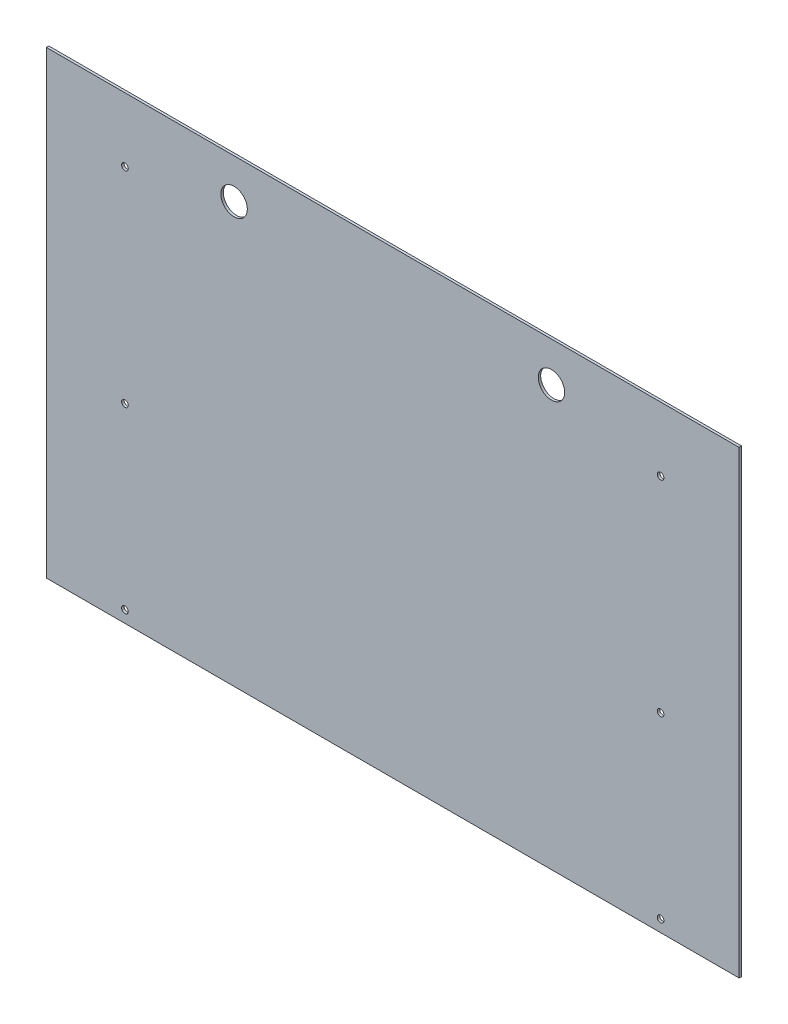
ISO-10303-21;
HEADER;
FILE_DESCRIPTION(('STEP AP214'),'2;1');
FILE_NAME('part.step','',(''),(''),'','','');
FILE_SCHEMA(('AUTOMOTIVE_DESIGN { 1 0 10303 214 1 1 1 1 }'));
ENDSEC;
DATA;
#1=APPLICATION_CONTEXT('core data for automotive mechanical design processes');
#2=APPLICATION_PROTOCOL_DEFINITION('international standard','automotive_design',2000,#1);
#3=PRODUCT_CONTEXT('',#1,'mechanical');
#4=PRODUCT('Part','Part','',(#3));
#5=PRODUCT_RELATED_PRODUCT_CATEGORY('part','',(#4));
#6=PRODUCT_DEFINITION_FORMATION('','',#4);
#7=PRODUCT_DEFINITION_CONTEXT('part definition',#1,'design');
#8=PRODUCT_DEFINITION('design','',#6,#7);
#9=PRODUCT_DEFINITION_SHAPE('','',#8);
#10=(LENGTH_UNIT() NAMED_UNIT(*) SI_UNIT(.MILLI.,.METRE.));
#11=(NAMED_UNIT(*) PLANE_ANGLE_UNIT() SI_UNIT($,.RADIAN.));
#12=(NAMED_UNIT(*) SI_UNIT($,.STERADIAN.) SOLID_ANGLE_UNIT());
#13=UNCERTAINTY_MEASURE_WITH_UNIT(LENGTH_MEASURE(1.E-05),#10,'distance_accuracy_value','');
#14=(GEOMETRIC_REPRESENTATION_CONTEXT(3) GLOBAL_UNCERTAINTY_ASSIGNED_CONTEXT((#13)) GLOBAL_UNIT_ASSIGNED_CONTEXT((#10,
#11,#12)) REPRESENTATION_CONTEXT('',''));
#15=CARTESIAN_POINT('',(0.,0.,0.));
#16=DIRECTION('',(0.,0.,1.));
#17=DIRECTION('',(1.,0.,0.));
#18=AXIS2_PLACEMENT_3D('',#15,#16,#17);
#19=CARTESIAN_POINT('',(-665.162499999999,1079.5,4.7625));
#20=DIRECTION('',(1.,0.,0.));
#21=DIRECTION('',(0.,1.,0.));
#22=AXIS2_PLACEMENT_3D('',#19,#20,#21);
#23=PLANE('',#22);
#24=DIRECTION('',(0.,-1.,0.));
#25=VECTOR('',#24,1.);
#26=CARTESIAN_POINT('',(-665.162499999999,1079.5,0.));
#27=LINE('',#26,#25);
#28=CARTESIAN_POINT('',(-665.162499999999,1079.5,0.));
#29=VERTEX_POINT('',#28);
#30=CARTESIAN_POINT('',(-665.162499999999,196.85,0.));
#31=VERTEX_POINT('',#30);
#32=EDGE_CURVE('E96',#29,#31,#27,.T.);
#33=ORIENTED_EDGE('',*,*,#32,.T.);
#34=DIRECTION('',(0.,0.,-1.));
#35=VECTOR('',#34,1.);
#36=CARTESIAN_POINT('',(-665.162499999999,196.85,4.7625));
#37=LINE('',#36,#35);
#38=CARTESIAN_POINT('',(-665.162499999999,196.85,4.7625));
#39=VERTEX_POINT('',#38);
#40=EDGE_CURVE('E11',#39,#31,#37,.T.);
#41=ORIENTED_EDGE('',*,*,#40,.F.);
#42=DIRECTION('',(0.,-1.,0.));
#43=VECTOR('',#42,1.);
#44=CARTESIAN_POINT('',(-665.162499999999,1079.5,4.7625));
#45=LINE('',#44,#43);
#46=CARTESIAN_POINT('',(-665.162499999999,1079.5,4.7625));
#47=VERTEX_POINT('',#46);
#48=EDGE_CURVE('E84',#47,#39,#45,.T.);
#49=ORIENTED_EDGE('',*,*,#48,.F.);
#50=DIRECTION('',(0.,0.,-1.));
#51=VECTOR('',#50,1.);
#52=CARTESIAN_POINT('',(-665.162499999999,1079.5,4.7625));
#53=LINE('',#52,#51);
#54=EDGE_CURVE('E92',#47,#29,#53,.T.);
#55=ORIENTED_EDGE('',*,*,#54,.T.);
#56=EDGE_LOOP('',(#33,#41,#49,#55));
#57=FACE_BOUND('',#56,.T.);
#58=ADVANCED_FACE('F33',(#57),#23,.F.);
#59=CARTESIAN_POINT('',(-665.162499999999,196.85,4.7625));
#60=DIRECTION('',(0.,1.,0.));
#61=DIRECTION('',(0.,0.,1.));
#62=AXIS2_PLACEMENT_3D('',#59,#60,#61);
#63=PLANE('',#62);
#64=DIRECTION('',(1.,0.,0.));
#65=VECTOR('',#64,1.);
#66=CARTESIAN_POINT('',(-665.162499999999,196.85,0.));
#67=LINE('',#66,#65);
#68=CARTESIAN_POINT('',(665.162499999999,196.85,0.));
#69=VERTEX_POINT('',#68);
#70=EDGE_CURVE('E88',#31,#69,#67,.T.);
#71=ORIENTED_EDGE('',*,*,#70,.T.);
#72=DIRECTION('',(0.,0.,-1.));
#73=VECTOR('',#72,1.);
#74=CARTESIAN_POINT('',(665.162499999999,196.85,4.7625));
#75=LINE('',#74,#73);
#76=CARTESIAN_POINT('',(665.162499999999,196.85,4.7625));
#77=VERTEX_POINT('',#76);
#78=EDGE_CURVE('E41',#77,#69,#75,.T.);
#79=ORIENTED_EDGE('',*,*,#78,.F.);
#80=DIRECTION('',(1.,0.,0.));
#81=VECTOR('',#80,1.);
#82=CARTESIAN_POINT('',(-665.162499999999,196.85,4.7625));
#83=LINE('',#82,#81);
#84=EDGE_CURVE('E79',#39,#77,#83,.T.);
#85=ORIENTED_EDGE('',*,*,#84,.F.);
#86=ORIENTED_EDGE('',*,*,#40,.T.);
#87=EDGE_LOOP('',(#71,#79,#85,#86));
#88=FACE_BOUND('',#87,.T.);
#89=ADVANCED_FACE('F87',(#88),#63,.F.);
#90=CARTESIAN_POINT('',(665.162499999999,1079.5,4.7625));
#91=DIRECTION('',(-1.,0.,0.));
#92=DIRECTION('',(0.,-1.,0.));
#93=AXIS2_PLACEMENT_3D('',#90,#91,#92);
#94=PLANE('',#93);
#95=DIRECTION('',(0.,1.,0.));
#96=VECTOR('',#95,1.);
#97=CARTESIAN_POINT('',(665.162499999999,1079.5,0.));
#98=LINE('',#97,#96);
#99=CARTESIAN_POINT('',(665.162499999999,1079.5,0.));
#100=VERTEX_POINT('',#99);
#101=EDGE_CURVE('E66',#69,#100,#98,.T.);
#102=ORIENTED_EDGE('',*,*,#101,.T.);
#103=DIRECTION('',(0.,0.,-1.));
#104=VECTOR('',#103,1.);
#105=CARTESIAN_POINT('',(665.162499999999,1079.5,4.7625));
#106=LINE('',#105,#104);
#107=CARTESIAN_POINT('',(665.162499999999,1079.5,4.7625));
#108=VERTEX_POINT('',#107);
#109=EDGE_CURVE('E89',#108,#100,#106,.T.);
#110=ORIENTED_EDGE('',*,*,#109,.F.);
#111=DIRECTION('',(0.,1.,0.));
#112=VECTOR('',#111,1.);
#113=CARTESIAN_POINT('',(665.162499999999,1079.5,4.7625));
#114=LINE('',#113,#112);
#115=EDGE_CURVE('E82',#77,#108,#114,.T.);
#116=ORIENTED_EDGE('',*,*,#115,.F.);
#117=ORIENTED_EDGE('',*,*,#78,.T.);
#118=EDGE_LOOP('',(#102,#110,#116,#117));
#119=FACE_BOUND('',#118,.T.);
#120=ADVANCED_FACE('F90',(#119),#94,.F.);
#121=CARTESIAN_POINT('',(-665.162499999999,1079.5,4.7625));
#122=DIRECTION('',(0.,-1.,0.));
#123=DIRECTION('',(0.,0.,-1.));
#124=AXIS2_PLACEMENT_3D('',#121,#122,#123);
#125=PLANE('',#124);
#126=DIRECTION('',(-1.,0.,0.));
#127=VECTOR('',#126,1.);
#128=CARTESIAN_POINT('',(-665.162499999999,1079.5,0.));
#129=LINE('',#128,#127);
#130=EDGE_CURVE('E72',#100,#29,#129,.T.);
#131=ORIENTED_EDGE('',*,*,#130,.T.);
#132=ORIENTED_EDGE('',*,*,#54,.F.);
#133=DIRECTION('',(-1.,0.,0.));
#134=VECTOR('',#133,1.);
#135=CARTESIAN_POINT('',(-665.162499999999,1079.5,4.7625));
#136=LINE('',#135,#134);
#137=EDGE_CURVE('E49',#108,#47,#136,.T.);
#138=ORIENTED_EDGE('',*,*,#137,.F.);
#139=ORIENTED_EDGE('',*,*,#109,.T.);
#140=EDGE_LOOP('',(#131,#132,#138,#139));
#141=FACE_BOUND('',#140,.T.);
#142=ADVANCED_FACE('F104',(#141),#125,.F.);
#143=CARTESIAN_POINT('',(-665.162499999999,196.85,4.7625));
#144=DIRECTION('',(0.,0.,1.));
#145=DIRECTION('',(1.,0.,0.));
#146=AXIS2_PLACEMENT_3D('',#143,#144,#145);
#147=PLANE('',#146);
#148=CARTESIAN_POINT('',(-304.8,1003.3,4.7625));
#149=DIRECTION('',(0.,0.,1.));
#150=DIRECTION('',(-1.,0.,0.));
#151=AXIS2_PLACEMENT_3D('',#148,#149,#150);
#152=CIRCLE('',#151,25.4);
#153=CARTESIAN_POINT('',(-330.2,1003.3,4.7625));
#154=VERTEX_POINT('',#153);
#155=EDGE_CURVE('E152',#154,#154,#152,.T.);
#156=ORIENTED_EDGE('',*,*,#155,.F.);
#157=EDGE_LOOP('',(#156));
#158=FACE_BOUND('',#157,.T.);
#159=CARTESIAN_POINT('',(304.8,1003.3,4.7625));
#160=DIRECTION('',(0.,0.,1.));
#161=DIRECTION('',(1.,0.,0.));
#162=AXIS2_PLACEMENT_3D('',#159,#160,#161);
#163=CIRCLE('',#162,25.4);
#164=CARTESIAN_POINT('',(330.2,1003.3,4.7625));
#165=VERTEX_POINT('',#164);
#166=EDGE_CURVE('E146',#165,#165,#163,.T.);
#167=ORIENTED_EDGE('',*,*,#166,.F.);
#168=EDGE_LOOP('',(#167));
#169=FACE_BOUND('',#168,.T.);
#170=CARTESIAN_POINT('',(-514.35,956.31,4.7625));
#171=DIRECTION('',(0.,0.,1.));
#172=DIRECTION('',(-1.,0.,0.));
#173=AXIS2_PLACEMENT_3D('',#170,#171,#172);
#174=CIRCLE('',#173,6.34999999999994);
#175=CARTESIAN_POINT('',(-520.7,956.31,4.7625));
#176=VERTEX_POINT('',#175);
#177=EDGE_CURVE('E140',#176,#176,#174,.T.);
#178=ORIENTED_EDGE('',*,*,#177,.F.);
#179=EDGE_LOOP('',(#178));
#180=FACE_BOUND('',#179,.T.);
#181=CARTESIAN_POINT('',(-514.35,562.61,4.7625));
#182=DIRECTION('',(0.,0.,1.));
#183=DIRECTION('',(-1.,0.,0.));
#184=AXIS2_PLACEMENT_3D('',#181,#182,#183);
#185=CIRCLE('',#184,6.34999999999994);
#186=CARTESIAN_POINT('',(-520.7,562.61,4.7625));
#187=VERTEX_POINT('',#186);
#188=EDGE_CURVE('E134',#187,#187,#185,.T.);
#189=ORIENTED_EDGE('',*,*,#188,.F.);
#190=EDGE_LOOP('',(#189));
#191=FACE_BOUND('',#190,.T.);
#192=CARTESIAN_POINT('',(-514.35,219.71,4.7625));
#193=DIRECTION('',(0.,0.,1.));
#194=DIRECTION('',(-1.,0.,0.));
#195=AXIS2_PLACEMENT_3D('',#192,#193,#194);
#196=CIRCLE('',#195,6.34999999999994);
#197=CARTESIAN_POINT('',(-520.7,219.71,4.7625));
#198=VERTEX_POINT('',#197);
#199=EDGE_CURVE('E128',#198,#198,#196,.T.);
#200=ORIENTED_EDGE('',*,*,#199,.F.);
#201=EDGE_LOOP('',(#200));
#202=FACE_BOUND('',#201,.T.);
#203=CARTESIAN_POINT('',(514.35,219.71,4.7625));
#204=DIRECTION('',(0.,0.,1.));
#205=DIRECTION('',(1.,0.,0.));
#206=AXIS2_PLACEMENT_3D('',#203,#204,#205);
#207=CIRCLE('',#206,6.34999999999994);
#208=CARTESIAN_POINT('',(520.7,219.71,4.7625));
#209=VERTEX_POINT('',#208);
#210=EDGE_CURVE('E122',#209,#209,#207,.T.);
#211=ORIENTED_EDGE('',*,*,#210,.F.);
#212=EDGE_LOOP('',(#211));
#213=FACE_BOUND('',#212,.T.);
#214=CARTESIAN_POINT('',(514.35,562.61,4.7625));
#215=DIRECTION('',(0.,0.,1.));
#216=DIRECTION('',(1.,0.,0.));
#217=AXIS2_PLACEMENT_3D('',#214,#215,#216);
#218=CIRCLE('',#217,6.34999999999994);
#219=CARTESIAN_POINT('',(520.7,562.61,4.7625));
#220=VERTEX_POINT('',#219);
#221=EDGE_CURVE('E116',#220,#220,#218,.T.);
#222=ORIENTED_EDGE('',*,*,#221,.F.);
#223=EDGE_LOOP('',(#222));
#224=FACE_BOUND('',#223,.T.);
#225=CARTESIAN_POINT('',(514.35,956.31,4.7625));
#226=DIRECTION('',(0.,0.,1.));
#227=DIRECTION('',(1.,0.,0.));
#228=AXIS2_PLACEMENT_3D('',#225,#226,#227);
#229=CIRCLE('',#228,6.34999999999994);
#230=CARTESIAN_POINT('',(520.7,956.31,4.7625));
#231=VERTEX_POINT('',#230);
#232=EDGE_CURVE('E110',#231,#231,#229,.T.);
#233=ORIENTED_EDGE('',*,*,#232,.F.);
#234=EDGE_LOOP('',(#233));
#235=FACE_BOUND('',#234,.T.);
#236=ORIENTED_EDGE('',*,*,#48,.T.);
#237=ORIENTED_EDGE('',*,*,#84,.T.);
#238=ORIENTED_EDGE('',*,*,#115,.T.);
#239=ORIENTED_EDGE('',*,*,#137,.T.);
#240=EDGE_LOOP('',(#236,#237,#238,#239));
#241=FACE_BOUND('',#240,.T.);
#242=ADVANCED_FACE('F80',(#158,#169,#180,#191,#202,#213,#224,#235,#241),#147,.T.);
#243=CARTESIAN_POINT('',(-665.162499999999,196.85,0.));
#244=DIRECTION('',(0.,0.,1.));
#245=DIRECTION('',(1.,0.,0.));
#246=AXIS2_PLACEMENT_3D('',#243,#244,#245);
#247=PLANE('',#246);
#248=CARTESIAN_POINT('',(-304.8,1003.3,0.));
#249=DIRECTION('',(0.,0.,1.));
#250=DIRECTION('',(-1.,0.,0.));
#251=AXIS2_PLACEMENT_3D('',#248,#249,#250);
#252=CIRCLE('',#251,25.4);
#253=CARTESIAN_POINT('',(-330.2,1003.3,0.));
#254=VERTEX_POINT('',#253);
#255=EDGE_CURVE('E149',#254,#254,#252,.T.);
#256=ORIENTED_EDGE('',*,*,#255,.T.);
#257=EDGE_LOOP('',(#256));
#258=FACE_BOUND('',#257,.T.);
#259=CARTESIAN_POINT('',(304.8,1003.3,0.));
#260=DIRECTION('',(0.,0.,1.));
#261=DIRECTION('',(1.,0.,0.));
#262=AXIS2_PLACEMENT_3D('',#259,#260,#261);
#263=CIRCLE('',#262,25.4);
#264=CARTESIAN_POINT('',(330.2,1003.3,0.));
#265=VERTEX_POINT('',#264);
#266=EDGE_CURVE('E143',#265,#265,#263,.T.);
#267=ORIENTED_EDGE('',*,*,#266,.T.);
#268=EDGE_LOOP('',(#267));
#269=FACE_BOUND('',#268,.T.);
#270=CARTESIAN_POINT('',(-514.35,956.31,0.));
#271=DIRECTION('',(0.,0.,1.));
#272=DIRECTION('',(-1.,0.,0.));
#273=AXIS2_PLACEMENT_3D('',#270,#271,#272);
#274=CIRCLE('',#273,6.34999999999994);
#275=CARTESIAN_POINT('',(-520.7,956.31,0.));
#276=VERTEX_POINT('',#275);
#277=EDGE_CURVE('E137',#276,#276,#274,.T.);
#278=ORIENTED_EDGE('',*,*,#277,.T.);
#279=EDGE_LOOP('',(#278));
#280=FACE_BOUND('',#279,.T.);
#281=CARTESIAN_POINT('',(-514.35,562.61,0.));
#282=DIRECTION('',(0.,0.,1.));
#283=DIRECTION('',(-1.,0.,0.));
#284=AXIS2_PLACEMENT_3D('',#281,#282,#283);
#285=CIRCLE('',#284,6.34999999999994);
#286=CARTESIAN_POINT('',(-520.7,562.61,0.));
#287=VERTEX_POINT('',#286);
#288=EDGE_CURVE('E131',#287,#287,#285,.T.);
#289=ORIENTED_EDGE('',*,*,#288,.T.);
#290=EDGE_LOOP('',(#289));
#291=FACE_BOUND('',#290,.T.);
#292=CARTESIAN_POINT('',(-514.35,219.71,0.));
#293=DIRECTION('',(0.,0.,1.));
#294=DIRECTION('',(-1.,0.,0.));
#295=AXIS2_PLACEMENT_3D('',#292,#293,#294);
#296=CIRCLE('',#295,6.34999999999994);
#297=CARTESIAN_POINT('',(-520.7,219.71,0.));
#298=VERTEX_POINT('',#297);
#299=EDGE_CURVE('E125',#298,#298,#296,.T.);
#300=ORIENTED_EDGE('',*,*,#299,.T.);
#301=EDGE_LOOP('',(#300));
#302=FACE_BOUND('',#301,.T.);
#303=CARTESIAN_POINT('',(514.35,219.71,0.));
#304=DIRECTION('',(0.,0.,1.));
#305=DIRECTION('',(1.,0.,0.));
#306=AXIS2_PLACEMENT_3D('',#303,#304,#305);
#307=CIRCLE('',#306,6.34999999999994);
#308=CARTESIAN_POINT('',(520.7,219.71,0.));
#309=VERTEX_POINT('',#308);
#310=EDGE_CURVE('E119',#309,#309,#307,.T.);
#311=ORIENTED_EDGE('',*,*,#310,.T.);
#312=EDGE_LOOP('',(#311));
#313=FACE_BOUND('',#312,.T.);
#314=CARTESIAN_POINT('',(514.35,562.61,0.));
#315=DIRECTION('',(0.,0.,1.));
#316=DIRECTION('',(1.,0.,0.));
#317=AXIS2_PLACEMENT_3D('',#314,#315,#316);
#318=CIRCLE('',#317,6.34999999999994);
#319=CARTESIAN_POINT('',(520.7,562.61,0.));
#320=VERTEX_POINT('',#319);
#321=EDGE_CURVE('E113',#320,#320,#318,.T.);
#322=ORIENTED_EDGE('',*,*,#321,.T.);
#323=EDGE_LOOP('',(#322));
#324=FACE_BOUND('',#323,.T.);
#325=CARTESIAN_POINT('',(514.35,956.31,0.));
#326=DIRECTION('',(0.,0.,1.));
#327=DIRECTION('',(1.,0.,0.));
#328=AXIS2_PLACEMENT_3D('',#325,#326,#327);
#329=CIRCLE('',#328,6.34999999999994);
#330=CARTESIAN_POINT('',(520.7,956.31,0.));
#331=VERTEX_POINT('',#330);
#332=EDGE_CURVE('E99',#331,#331,#329,.T.);
#333=ORIENTED_EDGE('',*,*,#332,.T.);
#334=EDGE_LOOP('',(#333));
#335=FACE_BOUND('',#334,.T.);
#336=ORIENTED_EDGE('',*,*,#32,.F.);
#337=ORIENTED_EDGE('',*,*,#130,.F.);
#338=ORIENTED_EDGE('',*,*,#101,.F.);
#339=ORIENTED_EDGE('',*,*,#70,.F.);
#340=EDGE_LOOP('',(#336,#337,#338,#339));
#341=FACE_BOUND('',#340,.T.);
#342=ADVANCED_FACE('F107',(#258,#269,#280,#291,#302,#313,#324,#335,#341),#247,.F.);
#343=CARTESIAN_POINT('',(514.35,956.31,0.));
#344=DIRECTION('',(0.,0.,1.));
#345=DIRECTION('',(1.,0.,0.));
#346=AXIS2_PLACEMENT_3D('',#343,#344,#345);
#347=CYLINDRICAL_SURFACE('',#346,6.34999999999994);
#348=ORIENTED_EDGE('',*,*,#332,.F.);
#349=EDGE_LOOP('',(#348));
#350=FACE_BOUND('',#349,.T.);
#351=ORIENTED_EDGE('',*,*,#232,.T.);
#352=EDGE_LOOP('',(#351));
#353=FACE_BOUND('',#352,.T.);
#354=ADVANCED_FACE('F184',(#350,#353),#347,.F.);
#355=CARTESIAN_POINT('',(514.35,562.61,0.));
#356=DIRECTION('',(0.,0.,1.));
#357=DIRECTION('',(1.,0.,0.));
#358=AXIS2_PLACEMENT_3D('',#355,#356,#357);
#359=CYLINDRICAL_SURFACE('',#358,6.34999999999994);
#360=ORIENTED_EDGE('',*,*,#321,.F.);
#361=EDGE_LOOP('',(#360));
#362=FACE_BOUND('',#361,.T.);
#363=ORIENTED_EDGE('',*,*,#221,.T.);
#364=EDGE_LOOP('',(#363));
#365=FACE_BOUND('',#364,.T.);
#366=ADVANCED_FACE('F186',(#362,#365),#359,.F.);
#367=CARTESIAN_POINT('',(514.35,219.71,0.));
#368=DIRECTION('',(0.,0.,1.));
#369=DIRECTION('',(1.,0.,0.));
#370=AXIS2_PLACEMENT_3D('',#367,#368,#369);
#371=CYLINDRICAL_SURFACE('',#370,6.34999999999994);
#372=ORIENTED_EDGE('',*,*,#310,.F.);
#373=EDGE_LOOP('',(#372));
#374=FACE_BOUND('',#373,.T.);
#375=ORIENTED_EDGE('',*,*,#210,.T.);
#376=EDGE_LOOP('',(#375));
#377=FACE_BOUND('',#376,.T.);
#378=ADVANCED_FACE('F193',(#374,#377),#371,.F.);
#379=CARTESIAN_POINT('',(-514.35,219.71,0.));
#380=DIRECTION('',(0.,0.,1.));
#381=DIRECTION('',(1.,0.,0.));
#382=AXIS2_PLACEMENT_3D('',#379,#380,#381);
#383=CYLINDRICAL_SURFACE('',#382,6.34999999999994);
#384=ORIENTED_EDGE('',*,*,#299,.F.);
#385=EDGE_LOOP('',(#384));
#386=FACE_BOUND('',#385,.T.);
#387=ORIENTED_EDGE('',*,*,#199,.T.);
#388=EDGE_LOOP('',(#387));
#389=FACE_BOUND('',#388,.T.);
#390=ADVANCED_FACE('F253',(#386,#389),#383,.F.);
#391=CARTESIAN_POINT('',(-514.35,562.61,0.));
#392=DIRECTION('',(0.,0.,1.));
#393=DIRECTION('',(1.,0.,0.));
#394=AXIS2_PLACEMENT_3D('',#391,#392,#393);
#395=CYLINDRICAL_SURFACE('',#394,6.34999999999994);
#396=ORIENTED_EDGE('',*,*,#288,.F.);
#397=EDGE_LOOP('',(#396));
#398=FACE_BOUND('',#397,.T.);
#399=ORIENTED_EDGE('',*,*,#188,.T.);
#400=EDGE_LOOP('',(#399));
#401=FACE_BOUND('',#400,.T.);
#402=ADVANCED_FACE('F246',(#398,#401),#395,.F.);
#403=CARTESIAN_POINT('',(-514.35,956.31,0.));
#404=DIRECTION('',(0.,0.,1.));
#405=DIRECTION('',(1.,0.,0.));
#406=AXIS2_PLACEMENT_3D('',#403,#404,#405);
#407=CYLINDRICAL_SURFACE('',#406,6.34999999999994);
#408=ORIENTED_EDGE('',*,*,#277,.F.);
#409=EDGE_LOOP('',(#408));
#410=FACE_BOUND('',#409,.T.);
#411=ORIENTED_EDGE('',*,*,#177,.T.);
#412=EDGE_LOOP('',(#411));
#413=FACE_BOUND('',#412,.T.);
#414=ADVANCED_FACE('F231',(#410,#413),#407,.F.);
#415=CARTESIAN_POINT('',(304.8,1003.3,0.));
#416=DIRECTION('',(0.,0.,1.));
#417=DIRECTION('',(1.,0.,0.));
#418=AXIS2_PLACEMENT_3D('',#415,#416,#417);
#419=CYLINDRICAL_SURFACE('',#418,25.4);
#420=ORIENTED_EDGE('',*,*,#266,.F.);
#421=EDGE_LOOP('',(#420));
#422=FACE_BOUND('',#421,.T.);
#423=ORIENTED_EDGE('',*,*,#166,.T.);
#424=EDGE_LOOP('',(#423));
#425=FACE_BOUND('',#424,.T.);
#426=ADVANCED_FACE('F163',(#422,#425),#419,.F.);
#427=CARTESIAN_POINT('',(-304.8,1003.3,0.));
#428=DIRECTION('',(0.,0.,1.));
#429=DIRECTION('',(1.,0.,0.));
#430=AXIS2_PLACEMENT_3D('',#427,#428,#429);
#431=CYLINDRICAL_SURFACE('',#430,25.4);
#432=ORIENTED_EDGE('',*,*,#255,.F.);
#433=EDGE_LOOP('',(#432));
#434=FACE_BOUND('',#433,.T.);
#435=ORIENTED_EDGE('',*,*,#155,.T.);
#436=EDGE_LOOP('',(#435));
#437=FACE_BOUND('',#436,.T.);
#438=ADVANCED_FACE('F160',(#434,#437),#431,.F.);
#439=CLOSED_SHELL('',(#58,#89,#120,#142,#242,#342,#354,#366,#378,#390,#402,#414,#426,#438));
#440=MANIFOLD_SOLID_BREP('B2',#439);
#441=ADVANCED_BREP_SHAPE_REPRESENTATION('',(#18,#440),#14);
#442=SHAPE_DEFINITION_REPRESENTATION(#9,#441);
ENDSEC;
END-ISO-10303-21;
